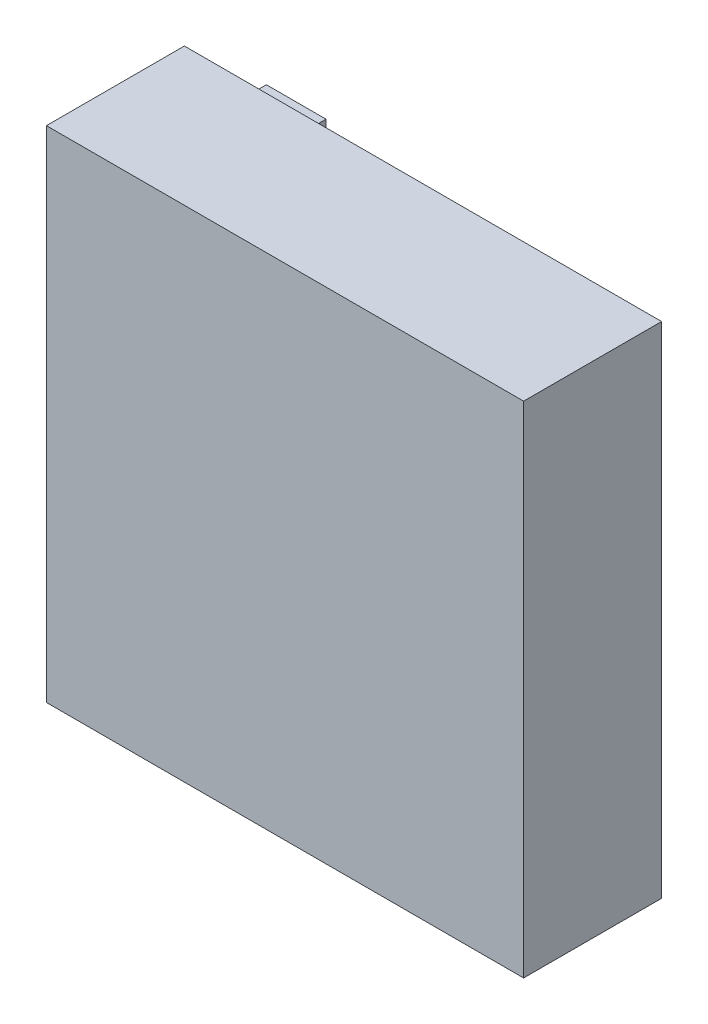
ISO-10303-21;
HEADER;
FILE_DESCRIPTION(('STEP AP214'),'2;1');
FILE_NAME('part.step','',(''),(''),'','','');
FILE_SCHEMA(('AUTOMOTIVE_DESIGN { 1 0 10303 214 1 1 1 1 }'));
ENDSEC;
DATA;
#1=APPLICATION_CONTEXT('core data for automotive mechanical design processes');
#2=APPLICATION_PROTOCOL_DEFINITION('international standard','automotive_design',2000,#1);
#3=PRODUCT_CONTEXT('',#1,'mechanical');
#4=PRODUCT('Part','Part','',(#3));
#5=PRODUCT_RELATED_PRODUCT_CATEGORY('part','',(#4));
#6=PRODUCT_DEFINITION_FORMATION('','',#4);
#7=PRODUCT_DEFINITION_CONTEXT('part definition',#1,'design');
#8=PRODUCT_DEFINITION('design','',#6,#7);
#9=PRODUCT_DEFINITION_SHAPE('','',#8);
#10=(LENGTH_UNIT() NAMED_UNIT(*) SI_UNIT(.MILLI.,.METRE.));
#11=(NAMED_UNIT(*) PLANE_ANGLE_UNIT() SI_UNIT($,.RADIAN.));
#12=(NAMED_UNIT(*) SI_UNIT($,.STERADIAN.) SOLID_ANGLE_UNIT());
#13=UNCERTAINTY_MEASURE_WITH_UNIT(LENGTH_MEASURE(1.E-05),#10,'distance_accuracy_value','');
#14=(GEOMETRIC_REPRESENTATION_CONTEXT(3) GLOBAL_UNCERTAINTY_ASSIGNED_CONTEXT((#13)) GLOBAL_UNIT_ASSIGNED_CONTEXT((#10,
#11,#12)) REPRESENTATION_CONTEXT('',''));
#15=CARTESIAN_POINT('',(0.,0.,0.));
#16=DIRECTION('',(0.,0.,1.));
#17=DIRECTION('',(1.,0.,0.));
#18=AXIS2_PLACEMENT_3D('',#15,#16,#17);
#19=CARTESIAN_POINT('',(0.,0.,0.));
#20=DIRECTION('',(0.,0.,1.));
#21=DIRECTION('',(1.,0.,0.));
#22=AXIS2_PLACEMENT_3D('',#19,#20,#21);
#23=PLANE('',#22);
#24=DIRECTION('',(0.,-1.,0.));
#25=VECTOR('',#24,1.);
#26=CARTESIAN_POINT('',(-32.,-33.5,0.));
#27=LINE('',#26,#25);
#28=CARTESIAN_POINT('',(-32.,33.5,0.));
#29=VERTEX_POINT('',#28);
#30=CARTESIAN_POINT('',(-32.,-33.5,0.));
#31=VERTEX_POINT('',#30);
#32=EDGE_CURVE('E118',#29,#31,#27,.T.);
#33=ORIENTED_EDGE('',*,*,#32,.F.);
#34=DIRECTION('',(-1.,0.,0.));
#35=VECTOR('',#34,1.);
#36=CARTESIAN_POINT('',(32.,33.5,0.));
#37=LINE('',#36,#35);
#38=CARTESIAN_POINT('',(32.,33.5,0.));
#39=VERTEX_POINT('',#38);
#40=EDGE_CURVE('E131',#39,#29,#37,.T.);
#41=ORIENTED_EDGE('',*,*,#40,.F.);
#42=DIRECTION('',(0.,1.,0.));
#43=VECTOR('',#42,1.);
#44=CARTESIAN_POINT('',(32.,-33.5,0.));
#45=LINE('',#44,#43);
#46=CARTESIAN_POINT('',(32.,-33.5,0.));
#47=VERTEX_POINT('',#46);
#48=EDGE_CURVE('E139',#47,#39,#45,.T.);
#49=ORIENTED_EDGE('',*,*,#48,.F.);
#50=DIRECTION('',(1.,0.,0.));
#51=VECTOR('',#50,1.);
#52=CARTESIAN_POINT('',(32.,-33.5,0.));
#53=LINE('',#52,#51);
#54=EDGE_CURVE('E121',#31,#47,#53,.T.);
#55=ORIENTED_EDGE('',*,*,#54,.F.);
#56=EDGE_LOOP('',(#33,#41,#49,#55));
#57=FACE_BOUND('',#56,.T.);
#58=DIRECTION('',(0.,-1.,0.));
#59=VECTOR('',#58,1.);
#60=CARTESIAN_POINT('',(-17.,30.5,0.));
#61=LINE('',#60,#59);
#62=CARTESIAN_POINT('',(-17.,30.5,0.));
#63=VERTEX_POINT('',#62);
#64=CARTESIAN_POINT('',(-17.,26.5,0.));
#65=VERTEX_POINT('',#64);
#66=EDGE_CURVE('E117',#63,#65,#61,.T.);
#67=ORIENTED_EDGE('',*,*,#66,.F.);
#68=DIRECTION('',(1.,0.,0.));
#69=VECTOR('',#68,1.);
#70=CARTESIAN_POINT('',(-25.,30.5,0.));
#71=LINE('',#70,#69);
#72=CARTESIAN_POINT('',(-25.,30.5,0.));
#73=VERTEX_POINT('',#72);
#74=EDGE_CURVE('E114',#73,#63,#71,.T.);
#75=ORIENTED_EDGE('',*,*,#74,.F.);
#76=DIRECTION('',(0.,1.,0.));
#77=VECTOR('',#76,1.);
#78=CARTESIAN_POINT('',(-25.,30.5,0.));
#79=LINE('',#78,#77);
#80=CARTESIAN_POINT('',(-25.,26.5,0.));
#81=VERTEX_POINT('',#80);
#82=EDGE_CURVE('E52',#81,#73,#79,.T.);
#83=ORIENTED_EDGE('',*,*,#82,.F.);
#84=DIRECTION('',(-1.,0.,0.));
#85=VECTOR('',#84,1.);
#86=CARTESIAN_POINT('',(-25.,26.5,0.));
#87=LINE('',#86,#85);
#88=EDGE_CURVE('E47',#65,#81,#87,.T.);
#89=ORIENTED_EDGE('',*,*,#88,.F.);
#90=EDGE_LOOP('',(#67,#75,#83,#89));
#91=FACE_BOUND('',#90,.T.);
#92=ADVANCED_FACE('F32',(#57,#91),#23,.F.);
#93=CARTESIAN_POINT('',(-32.,-33.5,18.5));
#94=DIRECTION('',(1.,0.,0.));
#95=DIRECTION('',(0.,0.,-1.));
#96=AXIS2_PLACEMENT_3D('',#93,#94,#95);
#97=PLANE('',#96);
#98=ORIENTED_EDGE('',*,*,#32,.T.);
#99=DIRECTION('',(0.,0.,-1.));
#100=VECTOR('',#99,1.);
#101=CARTESIAN_POINT('',(-32.,-33.5,18.5));
#102=LINE('',#101,#100);
#103=CARTESIAN_POINT('',(-32.,-33.5,18.5));
#104=VERTEX_POINT('',#103);
#105=EDGE_CURVE('E11',#104,#31,#102,.T.);
#106=ORIENTED_EDGE('',*,*,#105,.F.);
#107=DIRECTION('',(0.,-1.,0.));
#108=VECTOR('',#107,1.);
#109=CARTESIAN_POINT('',(-32.,-33.5,18.5));
#110=LINE('',#109,#108);
#111=CARTESIAN_POINT('',(-32.,33.5,18.5));
#112=VERTEX_POINT('',#111);
#113=EDGE_CURVE('E127',#112,#104,#110,.T.);
#114=ORIENTED_EDGE('',*,*,#113,.F.);
#115=DIRECTION('',(0.,0.,-1.));
#116=VECTOR('',#115,1.);
#117=CARTESIAN_POINT('',(-32.,33.5,18.5));
#118=LINE('',#117,#116);
#119=EDGE_CURVE('E136',#112,#29,#118,.T.);
#120=ORIENTED_EDGE('',*,*,#119,.T.);
#121=EDGE_LOOP('',(#98,#106,#114,#120));
#122=FACE_BOUND('',#121,.T.);
#123=ADVANCED_FACE('F34',(#122),#97,.F.);
#124=CARTESIAN_POINT('',(32.,-33.5,18.5));
#125=DIRECTION('',(0.,1.,0.));
#126=DIRECTION('',(0.,0.,1.));
#127=AXIS2_PLACEMENT_3D('',#124,#125,#126);
#128=PLANE('',#127);
#129=ORIENTED_EDGE('',*,*,#54,.T.);
#130=DIRECTION('',(0.,0.,-1.));
#131=VECTOR('',#130,1.);
#132=CARTESIAN_POINT('',(32.,-33.5,18.5));
#133=LINE('',#132,#131);
#134=CARTESIAN_POINT('',(32.,-33.5,18.5));
#135=VERTEX_POINT('',#134);
#136=EDGE_CURVE('E40',#135,#47,#133,.T.);
#137=ORIENTED_EDGE('',*,*,#136,.F.);
#138=DIRECTION('',(1.,0.,0.));
#139=VECTOR('',#138,1.);
#140=CARTESIAN_POINT('',(32.,-33.5,18.5));
#141=LINE('',#140,#139);
#142=EDGE_CURVE('E130',#104,#135,#141,.T.);
#143=ORIENTED_EDGE('',*,*,#142,.F.);
#144=ORIENTED_EDGE('',*,*,#105,.T.);
#145=EDGE_LOOP('',(#129,#137,#143,#144));
#146=FACE_BOUND('',#145,.T.);
#147=ADVANCED_FACE('F166',(#146),#128,.F.);
#148=CARTESIAN_POINT('',(32.,-33.5,18.5));
#149=DIRECTION('',(-1.,0.,0.));
#150=DIRECTION('',(0.,0.,1.));
#151=AXIS2_PLACEMENT_3D('',#148,#149,#150);
#152=PLANE('',#151);
#153=ORIENTED_EDGE('',*,*,#48,.T.);
#154=DIRECTION('',(0.,0.,-1.));
#155=VECTOR('',#154,1.);
#156=CARTESIAN_POINT('',(32.,33.5,18.5));
#157=LINE('',#156,#155);
#158=CARTESIAN_POINT('',(32.,33.5,18.5));
#159=VERTEX_POINT('',#158);
#160=EDGE_CURVE('E144',#159,#39,#157,.T.);
#161=ORIENTED_EDGE('',*,*,#160,.F.);
#162=DIRECTION('',(0.,1.,0.));
#163=VECTOR('',#162,1.);
#164=CARTESIAN_POINT('',(32.,-33.5,18.5));
#165=LINE('',#164,#163);
#166=EDGE_CURVE('E133',#135,#159,#165,.T.);
#167=ORIENTED_EDGE('',*,*,#166,.F.);
#168=ORIENTED_EDGE('',*,*,#136,.T.);
#169=EDGE_LOOP('',(#153,#161,#167,#168));
#170=FACE_BOUND('',#169,.T.);
#171=ADVANCED_FACE('F151',(#170),#152,.F.);
#172=CARTESIAN_POINT('',(32.,33.5,18.5));
#173=DIRECTION('',(0.,-1.,0.));
#174=DIRECTION('',(0.,0.,-1.));
#175=AXIS2_PLACEMENT_3D('',#172,#173,#174);
#176=PLANE('',#175);
#177=ORIENTED_EDGE('',*,*,#40,.T.);
#178=ORIENTED_EDGE('',*,*,#119,.F.);
#179=DIRECTION('',(-1.,0.,0.));
#180=VECTOR('',#179,1.);
#181=CARTESIAN_POINT('',(32.,33.5,18.5));
#182=LINE('',#181,#180);
#183=EDGE_CURVE('E135',#159,#112,#182,.T.);
#184=ORIENTED_EDGE('',*,*,#183,.F.);
#185=ORIENTED_EDGE('',*,*,#160,.T.);
#186=EDGE_LOOP('',(#177,#178,#184,#185));
#187=FACE_BOUND('',#186,.T.);
#188=ADVANCED_FACE('F159',(#187),#176,.F.);
#189=CARTESIAN_POINT('',(0.,0.,18.5));
#190=DIRECTION('',(0.,0.,1.));
#191=DIRECTION('',(1.,0.,0.));
#192=AXIS2_PLACEMENT_3D('',#189,#190,#191);
#193=PLANE('',#192);
#194=ORIENTED_EDGE('',*,*,#113,.T.);
#195=ORIENTED_EDGE('',*,*,#142,.T.);
#196=ORIENTED_EDGE('',*,*,#166,.T.);
#197=ORIENTED_EDGE('',*,*,#183,.T.);
#198=EDGE_LOOP('',(#194,#195,#196,#197));
#199=FACE_BOUND('',#198,.T.);
#200=ADVANCED_FACE('F165',(#199),#193,.T.);
#201=CARTESIAN_POINT('',(-17.,30.5,-4.));
#202=DIRECTION('',(-1.,0.,0.));
#203=DIRECTION('',(0.,0.,1.));
#204=AXIS2_PLACEMENT_3D('',#201,#202,#203);
#205=PLANE('',#204);
#206=ORIENTED_EDGE('',*,*,#66,.T.);
#207=DIRECTION('',(0.,0.,1.));
#208=VECTOR('',#207,1.);
#209=CARTESIAN_POINT('',(-17.,26.5,-4.));
#210=LINE('',#209,#208);
#211=CARTESIAN_POINT('',(-17.,26.5,-4.));
#212=VERTEX_POINT('',#211);
#213=EDGE_CURVE('E98',#212,#65,#210,.T.);
#214=ORIENTED_EDGE('',*,*,#213,.F.);
#215=DIRECTION('',(0.,-1.,0.));
#216=VECTOR('',#215,1.);
#217=CARTESIAN_POINT('',(-17.,30.5,-4.));
#218=LINE('',#217,#216);
#219=CARTESIAN_POINT('',(-17.,30.5,-4.));
#220=VERTEX_POINT('',#219);
#221=EDGE_CURVE('E105',#220,#212,#218,.T.);
#222=ORIENTED_EDGE('',*,*,#221,.F.);
#223=DIRECTION('',(0.,0.,1.));
#224=VECTOR('',#223,1.);
#225=CARTESIAN_POINT('',(-17.,30.5,-4.));
#226=LINE('',#225,#224);
#227=EDGE_CURVE('E259',#220,#63,#226,.T.);
#228=ORIENTED_EDGE('',*,*,#227,.T.);
#229=EDGE_LOOP('',(#206,#214,#222,#228));
#230=FACE_BOUND('',#229,.T.);
#231=ADVANCED_FACE('F116',(#230),#205,.F.);
#232=CARTESIAN_POINT('',(-25.,26.5,-4.));
#233=DIRECTION('',(0.,1.,0.));
#234=DIRECTION('',(-1.,0.,0.));
#235=AXIS2_PLACEMENT_3D('',#232,#233,#234);
#236=PLANE('',#235);
#237=ORIENTED_EDGE('',*,*,#88,.T.);
#238=DIRECTION('',(0.,0.,1.));
#239=VECTOR('',#238,1.);
#240=CARTESIAN_POINT('',(-25.,26.5,-4.));
#241=LINE('',#240,#239);
#242=CARTESIAN_POINT('',(-25.,26.5,-4.));
#243=VERTEX_POINT('',#242);
#244=EDGE_CURVE('E101',#243,#81,#241,.T.);
#245=ORIENTED_EDGE('',*,*,#244,.F.);
#246=DIRECTION('',(-1.,0.,0.));
#247=VECTOR('',#246,1.);
#248=CARTESIAN_POINT('',(-25.,26.5,-4.));
#249=LINE('',#248,#247);
#250=EDGE_CURVE('E94',#212,#243,#249,.T.);
#251=ORIENTED_EDGE('',*,*,#250,.F.);
#252=ORIENTED_EDGE('',*,*,#213,.T.);
#253=EDGE_LOOP('',(#237,#245,#251,#252));
#254=FACE_BOUND('',#253,.T.);
#255=ADVANCED_FACE('F96',(#254),#236,.F.);
#256=CARTESIAN_POINT('',(-25.,30.5,-4.));
#257=DIRECTION('',(1.,0.,0.));
#258=DIRECTION('',(0.,0.,-1.));
#259=AXIS2_PLACEMENT_3D('',#256,#257,#258);
#260=PLANE('',#259);
#261=ORIENTED_EDGE('',*,*,#82,.T.);
#262=DIRECTION('',(0.,0.,1.));
#263=VECTOR('',#262,1.);
#264=CARTESIAN_POINT('',(-25.,30.5,-4.));
#265=LINE('',#264,#263);
#266=CARTESIAN_POINT('',(-25.,30.5,-4.));
#267=VERTEX_POINT('',#266);
#268=EDGE_CURVE('E123',#267,#73,#265,.T.);
#269=ORIENTED_EDGE('',*,*,#268,.F.);
#270=DIRECTION('',(0.,1.,0.));
#271=VECTOR('',#270,1.);
#272=CARTESIAN_POINT('',(-25.,30.5,-4.));
#273=LINE('',#272,#271);
#274=EDGE_CURVE('E104',#243,#267,#273,.T.);
#275=ORIENTED_EDGE('',*,*,#274,.F.);
#276=ORIENTED_EDGE('',*,*,#244,.T.);
#277=EDGE_LOOP('',(#261,#269,#275,#276));
#278=FACE_BOUND('',#277,.T.);
#279=ADVANCED_FACE('F190',(#278),#260,.F.);
#280=CARTESIAN_POINT('',(-25.,30.5,-4.));
#281=DIRECTION('',(0.,-1.,0.));
#282=DIRECTION('',(1.,0.,0.));
#283=AXIS2_PLACEMENT_3D('',#280,#281,#282);
#284=PLANE('',#283);
#285=ORIENTED_EDGE('',*,*,#74,.T.);
#286=ORIENTED_EDGE('',*,*,#227,.F.);
#287=DIRECTION('',(1.,0.,0.));
#288=VECTOR('',#287,1.);
#289=CARTESIAN_POINT('',(-25.,30.5,-4.));
#290=LINE('',#289,#288);
#291=EDGE_CURVE('E110',#267,#220,#290,.T.);
#292=ORIENTED_EDGE('',*,*,#291,.F.);
#293=ORIENTED_EDGE('',*,*,#268,.T.);
#294=EDGE_LOOP('',(#285,#286,#292,#293));
#295=FACE_BOUND('',#294,.T.);
#296=ADVANCED_FACE('F195',(#295),#284,.F.);
#297=CARTESIAN_POINT('',(0.,0.,-4.));
#298=DIRECTION('',(0.,0.,1.));
#299=DIRECTION('',(1.,0.,0.));
#300=AXIS2_PLACEMENT_3D('',#297,#298,#299);
#301=PLANE('',#300);
#302=ORIENTED_EDGE('',*,*,#221,.T.);
#303=ORIENTED_EDGE('',*,*,#250,.T.);
#304=ORIENTED_EDGE('',*,*,#274,.T.);
#305=ORIENTED_EDGE('',*,*,#291,.T.);
#306=EDGE_LOOP('',(#302,#303,#304,#305));
#307=FACE_BOUND('',#306,.T.);
#308=ADVANCED_FACE('F108',(#307),#301,.F.);
#309=CLOSED_SHELL('',(#92,#123,#147,#171,#188,#200,#231,#255,#279,#296,#308));
#310=MANIFOLD_SOLID_BREP('B2',#309);
#311=ADVANCED_BREP_SHAPE_REPRESENTATION('',(#18,#310),#14);
#312=SHAPE_DEFINITION_REPRESENTATION(#9,#311);
ENDSEC;
END-ISO-10303-21;
